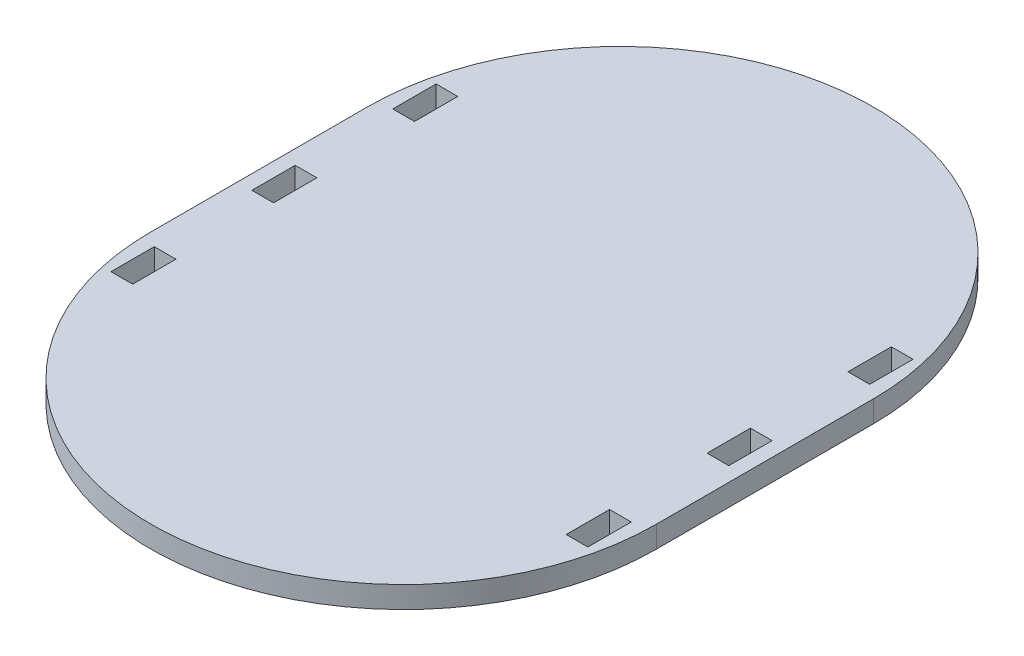
ISO-10303-21;
HEADER;
FILE_DESCRIPTION(('STEP AP214'),'2;1');
FILE_NAME('part.step','',(''),(''),'','','');
FILE_SCHEMA(('AUTOMOTIVE_DESIGN { 1 0 10303 214 1 1 1 1 }'));
ENDSEC;
DATA;
#1=APPLICATION_CONTEXT('core data for automotive mechanical design processes');
#2=APPLICATION_PROTOCOL_DEFINITION('international standard','automotive_design',2000,#1);
#3=PRODUCT_CONTEXT('',#1,'mechanical');
#4=PRODUCT('Part','Part','',(#3));
#5=PRODUCT_RELATED_PRODUCT_CATEGORY('part','',(#4));
#6=PRODUCT_DEFINITION_FORMATION('','',#4);
#7=PRODUCT_DEFINITION_CONTEXT('part definition',#1,'design');
#8=PRODUCT_DEFINITION('design','',#6,#7);
#9=PRODUCT_DEFINITION_SHAPE('','',#8);
#10=(LENGTH_UNIT() NAMED_UNIT(*) SI_UNIT(.MILLI.,.METRE.));
#11=(NAMED_UNIT(*) PLANE_ANGLE_UNIT() SI_UNIT($,.RADIAN.));
#12=(NAMED_UNIT(*) SI_UNIT($,.STERADIAN.) SOLID_ANGLE_UNIT());
#13=UNCERTAINTY_MEASURE_WITH_UNIT(LENGTH_MEASURE(1.E-05),#10,'distance_accuracy_value','');
#14=(GEOMETRIC_REPRESENTATION_CONTEXT(3) GLOBAL_UNCERTAINTY_ASSIGNED_CONTEXT((#13)) GLOBAL_UNIT_ASSIGNED_CONTEXT((#10,
#11,#12)) REPRESENTATION_CONTEXT('',''));
#15=CARTESIAN_POINT('',(0.,0.,0.));
#16=DIRECTION('',(0.,0.,1.));
#17=DIRECTION('',(1.,0.,0.));
#18=AXIS2_PLACEMENT_3D('',#15,#16,#17);
#19=CARTESIAN_POINT('',(88.9,7.62,0.));
#20=DIRECTION('',(-1.,0.,0.));
#21=DIRECTION('',(0.,0.,1.));
#22=AXIS2_PLACEMENT_3D('',#19,#20,#21);
#23=PLANE('',#22);
#24=DIRECTION('',(0.,0.,-1.));
#25=VECTOR('',#24,1.);
#26=CARTESIAN_POINT('',(88.9,0.,0.));
#27=LINE('',#26,#25);
#28=CARTESIAN_POINT('',(88.9,0.,0.));
#29=VERTEX_POINT('',#28);
#30=CARTESIAN_POINT('',(88.9,0.,-76.2));
#31=VERTEX_POINT('',#30);
#32=EDGE_CURVE('E410',#29,#31,#27,.T.);
#33=ORIENTED_EDGE('',*,*,#32,.T.);
#34=DIRECTION('',(0.,-1.,0.));
#35=VECTOR('',#34,1.);
#36=CARTESIAN_POINT('',(88.9,7.62,-76.2));
#37=LINE('',#36,#35);
#38=CARTESIAN_POINT('',(88.9,7.62,-76.2));
#39=VERTEX_POINT('',#38);
#40=EDGE_CURVE('E11',#39,#31,#37,.T.);
#41=ORIENTED_EDGE('',*,*,#40,.F.);
#42=DIRECTION('',(0.,0.,-1.));
#43=VECTOR('',#42,1.);
#44=CARTESIAN_POINT('',(88.9,7.62,0.));
#45=LINE('',#44,#43);
#46=CARTESIAN_POINT('',(88.9,7.62,0.));
#47=VERTEX_POINT('',#46);
#48=EDGE_CURVE('E417',#47,#39,#45,.T.);
#49=ORIENTED_EDGE('',*,*,#48,.F.);
#50=DIRECTION('',(0.,-1.,0.));
#51=VECTOR('',#50,1.);
#52=CARTESIAN_POINT('',(88.9,7.62,0.));
#53=LINE('',#52,#51);
#54=EDGE_CURVE('E428',#47,#29,#53,.T.);
#55=ORIENTED_EDGE('',*,*,#54,.T.);
#56=EDGE_LOOP('',(#33,#41,#49,#55));
#57=FACE_BOUND('',#56,.T.);
#58=ADVANCED_FACE('F33',(#57),#23,.F.);
#59=CARTESIAN_POINT('',(0.,7.62,-76.2));
#60=DIRECTION('',(0.,-1.,0.));
#61=DIRECTION('',(0.,0.,-1.));
#62=AXIS2_PLACEMENT_3D('',#59,#60,#61);
#63=CYLINDRICAL_SURFACE('',#62,88.9);
#64=CARTESIAN_POINT('',(0.,0.,-76.2));
#65=DIRECTION('',(0.,1.,0.));
#66=DIRECTION('',(0.,0.,1.));
#67=AXIS2_PLACEMENT_3D('',#64,#65,#66);
#68=CIRCLE('',#67,88.9);
#69=CARTESIAN_POINT('',(-88.9,0.,-76.2));
#70=VERTEX_POINT('',#69);
#71=EDGE_CURVE('E431',#31,#70,#68,.T.);
#72=ORIENTED_EDGE('',*,*,#71,.T.);
#73=DIRECTION('',(0.,-1.,0.));
#74=VECTOR('',#73,1.);
#75=CARTESIAN_POINT('',(-88.9,7.62,-76.2));
#76=LINE('',#75,#74);
#77=CARTESIAN_POINT('',(-88.9,7.62,-76.2));
#78=VERTEX_POINT('',#77);
#79=EDGE_CURVE('E40',#78,#70,#76,.T.);
#80=ORIENTED_EDGE('',*,*,#79,.F.);
#81=CARTESIAN_POINT('',(0.,7.62,-76.2));
#82=DIRECTION('',(0.,1.,0.));
#83=DIRECTION('',(0.,0.,1.));
#84=AXIS2_PLACEMENT_3D('',#81,#82,#83);
#85=CIRCLE('',#84,88.9);
#86=EDGE_CURVE('E420',#39,#78,#85,.T.);
#87=ORIENTED_EDGE('',*,*,#86,.F.);
#88=ORIENTED_EDGE('',*,*,#40,.T.);
#89=EDGE_LOOP('',(#72,#80,#87,#88));
#90=FACE_BOUND('',#89,.T.);
#91=ADVANCED_FACE('F447',(#90),#63,.T.);
#92=CARTESIAN_POINT('',(-88.9,7.62,0.));
#93=DIRECTION('',(-1.,0.,0.));
#94=DIRECTION('',(0.,0.,1.));
#95=AXIS2_PLACEMENT_3D('',#92,#93,#94);
#96=PLANE('',#95);
#97=DIRECTION('',(0.,0.,-1.));
#98=VECTOR('',#97,1.);
#99=CARTESIAN_POINT('',(-88.9,0.,0.));
#100=LINE('',#99,#98);
#101=CARTESIAN_POINT('',(-88.9,0.,0.));
#102=VERTEX_POINT('',#101);
#103=EDGE_CURVE('E434',#102,#70,#100,.T.);
#104=ORIENTED_EDGE('',*,*,#103,.F.);
#105=DIRECTION('',(0.,-1.,0.));
#106=VECTOR('',#105,1.);
#107=CARTESIAN_POINT('',(-88.9,7.62,0.));
#108=LINE('',#107,#106);
#109=CARTESIAN_POINT('',(-88.9,7.62,0.));
#110=VERTEX_POINT('',#109);
#111=EDGE_CURVE('E440',#110,#102,#108,.T.);
#112=ORIENTED_EDGE('',*,*,#111,.F.);
#113=DIRECTION('',(0.,0.,-1.));
#114=VECTOR('',#113,1.);
#115=CARTESIAN_POINT('',(-88.9,7.62,0.));
#116=LINE('',#115,#114);
#117=EDGE_CURVE('E423',#110,#78,#116,.T.);
#118=ORIENTED_EDGE('',*,*,#117,.T.);
#119=ORIENTED_EDGE('',*,*,#79,.T.);
#120=EDGE_LOOP('',(#104,#112,#118,#119));
#121=FACE_BOUND('',#120,.T.);
#122=ADVANCED_FACE('F444',(#121),#96,.T.);
#123=CARTESIAN_POINT('',(0.,7.62,0.));
#124=DIRECTION('',(0.,-1.,0.));
#125=DIRECTION('',(0.,0.,-1.));
#126=AXIS2_PLACEMENT_3D('',#123,#124,#125);
#127=CYLINDRICAL_SURFACE('',#126,88.9);
#128=CARTESIAN_POINT('',(0.,0.,0.));
#129=DIRECTION('',(0.,1.,0.));
#130=DIRECTION('',(0.,0.,1.));
#131=AXIS2_PLACEMENT_3D('',#128,#129,#130);
#132=CIRCLE('',#131,88.9);
#133=EDGE_CURVE('E421',#102,#29,#132,.T.);
#134=ORIENTED_EDGE('',*,*,#133,.T.);
#135=ORIENTED_EDGE('',*,*,#54,.F.);
#136=CARTESIAN_POINT('',(0.,7.62,0.));
#137=DIRECTION('',(0.,1.,0.));
#138=DIRECTION('',(0.,0.,1.));
#139=AXIS2_PLACEMENT_3D('',#136,#137,#138);
#140=CIRCLE('',#139,88.9);
#141=EDGE_CURVE('E426',#110,#47,#140,.T.);
#142=ORIENTED_EDGE('',*,*,#141,.F.);
#143=ORIENTED_EDGE('',*,*,#111,.T.);
#144=EDGE_LOOP('',(#134,#135,#142,#143));
#145=FACE_BOUND('',#144,.T.);
#146=ADVANCED_FACE('F454',(#145),#127,.T.);
#147=CARTESIAN_POINT('',(0.,7.62,-76.2));
#148=DIRECTION('',(0.,1.,0.));
#149=DIRECTION('',(0.,0.,1.));
#150=AXIS2_PLACEMENT_3D('',#147,#148,#149);
#151=PLANE('',#150);
#152=DIRECTION('',(0.,0.,1.));
#153=VECTOR('',#152,1.);
#154=CARTESIAN_POINT('',(-83.82,7.62,19.05));
#155=LINE('',#154,#153);
#156=CARTESIAN_POINT('',(-83.82,7.62,3.81));
#157=VERTEX_POINT('',#156);
#158=CARTESIAN_POINT('',(-83.82,7.62,19.05));
#159=VERTEX_POINT('',#158);
#160=EDGE_CURVE('E47',#157,#159,#155,.T.);
#161=ORIENTED_EDGE('',*,*,#160,.F.);
#162=DIRECTION('',(-1.,0.,0.));
#163=VECTOR('',#162,1.);
#164=CARTESIAN_POINT('',(-83.82,7.62,3.81));
#165=LINE('',#164,#163);
#166=CARTESIAN_POINT('',(-76.2,7.62,3.81));
#167=VERTEX_POINT('',#166);
#168=EDGE_CURVE('E265',#167,#157,#165,.T.);
#169=ORIENTED_EDGE('',*,*,#168,.F.);
#170=DIRECTION('',(0.,0.,-1.));
#171=VECTOR('',#170,1.);
#172=CARTESIAN_POINT('',(-76.2,7.62,19.05));
#173=LINE('',#172,#171);
#174=CARTESIAN_POINT('',(-76.2,7.62,19.05));
#175=VERTEX_POINT('',#174);
#176=EDGE_CURVE('E280',#175,#167,#173,.T.);
#177=ORIENTED_EDGE('',*,*,#176,.F.);
#178=DIRECTION('',(1.,0.,0.));
#179=VECTOR('',#178,1.);
#180=CARTESIAN_POINT('',(-83.82,7.62,19.05));
#181=LINE('',#180,#179);
#182=EDGE_CURVE('E276',#159,#175,#181,.T.);
#183=ORIENTED_EDGE('',*,*,#182,.F.);
#184=EDGE_LOOP('',(#161,#169,#177,#183));
#185=FACE_BOUND('',#184,.T.);
#186=DIRECTION('',(0.,0.,-1.));
#187=VECTOR('',#186,1.);
#188=CARTESIAN_POINT('',(83.82,7.62,19.05));
#189=LINE('',#188,#187);
#190=CARTESIAN_POINT('',(83.82,7.62,19.05));
#191=VERTEX_POINT('',#190);
#192=CARTESIAN_POINT('',(83.82,7.62,3.80999999999999));
#193=VERTEX_POINT('',#192);
#194=EDGE_CURVE('E55',#191,#193,#189,.T.);
#195=ORIENTED_EDGE('',*,*,#194,.F.);
#196=DIRECTION('',(1.,0.,0.));
#197=VECTOR('',#196,1.);
#198=CARTESIAN_POINT('',(83.82,7.62,19.05));
#199=LINE('',#198,#197);
#200=CARTESIAN_POINT('',(76.2,7.62,19.05));
#201=VERTEX_POINT('',#200);
#202=EDGE_CURVE('E297',#201,#191,#199,.T.);
#203=ORIENTED_EDGE('',*,*,#202,.F.);
#204=DIRECTION('',(0.,0.,1.));
#205=VECTOR('',#204,1.);
#206=CARTESIAN_POINT('',(76.2,7.62,19.05));
#207=LINE('',#206,#205);
#208=CARTESIAN_POINT('',(76.2,7.62,3.81));
#209=VERTEX_POINT('',#208);
#210=EDGE_CURVE('E312',#209,#201,#207,.T.);
#211=ORIENTED_EDGE('',*,*,#210,.F.);
#212=DIRECTION('',(-1.,0.,0.));
#213=VECTOR('',#212,1.);
#214=CARTESIAN_POINT('',(83.82,7.62,3.81));
#215=LINE('',#214,#213);
#216=EDGE_CURVE('E308',#193,#209,#215,.T.);
#217=ORIENTED_EDGE('',*,*,#216,.F.);
#218=EDGE_LOOP('',(#195,#203,#211,#217));
#219=FACE_BOUND('',#218,.T.);
#220=DIRECTION('',(0.,0.,-1.));
#221=VECTOR('',#220,1.);
#222=CARTESIAN_POINT('',(83.82,7.62,-95.25));
#223=LINE('',#222,#221);
#224=CARTESIAN_POINT('',(83.82,7.62,-80.01));
#225=VERTEX_POINT('',#224);
#226=CARTESIAN_POINT('',(83.82,7.62,-95.25));
#227=VERTEX_POINT('',#226);
#228=EDGE_CURVE('E337',#225,#227,#223,.T.);
#229=ORIENTED_EDGE('',*,*,#228,.F.);
#230=DIRECTION('',(1.,0.,0.));
#231=VECTOR('',#230,1.);
#232=CARTESIAN_POINT('',(83.82,7.62,-80.01));
#233=LINE('',#232,#231);
#234=CARTESIAN_POINT('',(76.2,7.62,-80.01));
#235=VERTEX_POINT('',#234);
#236=EDGE_CURVE('E327',#235,#225,#233,.T.);
#237=ORIENTED_EDGE('',*,*,#236,.F.);
#238=DIRECTION('',(0.,0.,1.));
#239=VECTOR('',#238,1.);
#240=CARTESIAN_POINT('',(76.2,7.62,-95.25));
#241=LINE('',#240,#239);
#242=CARTESIAN_POINT('',(76.2,7.62,-95.25));
#243=VERTEX_POINT('',#242);
#244=EDGE_CURVE('E343',#243,#235,#241,.T.);
#245=ORIENTED_EDGE('',*,*,#244,.F.);
#246=DIRECTION('',(-1.,0.,0.));
#247=VECTOR('',#246,1.);
#248=CARTESIAN_POINT('',(83.82,7.62,-95.25));
#249=LINE('',#248,#247);
#250=EDGE_CURVE('E339',#227,#243,#249,.T.);
#251=ORIENTED_EDGE('',*,*,#250,.F.);
#252=EDGE_LOOP('',(#229,#237,#245,#251));
#253=FACE_BOUND('',#252,.T.);
#254=DIRECTION('',(0.,0.,1.));
#255=VECTOR('',#254,1.);
#256=CARTESIAN_POINT('',(-83.82,7.62,-45.72));
#257=LINE('',#256,#255);
#258=CARTESIAN_POINT('',(-83.82,7.62,-45.72));
#259=VERTEX_POINT('',#258);
#260=CARTESIAN_POINT('',(-83.82,7.62,-30.48));
#261=VERTEX_POINT('',#260);
#262=EDGE_CURVE('E257',#259,#261,#257,.T.);
#263=ORIENTED_EDGE('',*,*,#262,.F.);
#264=DIRECTION('',(-1.,0.,0.));
#265=VECTOR('',#264,1.);
#266=CARTESIAN_POINT('',(-83.82,7.62,-45.72));
#267=LINE('',#266,#265);
#268=CARTESIAN_POINT('',(-76.2,7.62,-45.72));
#269=VERTEX_POINT('',#268);
#270=EDGE_CURVE('E359',#269,#259,#267,.T.);
#271=ORIENTED_EDGE('',*,*,#270,.F.);
#272=DIRECTION('',(0.,0.,-1.));
#273=VECTOR('',#272,1.);
#274=CARTESIAN_POINT('',(-76.2,7.62,-45.72));
#275=LINE('',#274,#273);
#276=CARTESIAN_POINT('',(-76.2,7.62,-30.48));
#277=VERTEX_POINT('',#276);
#278=EDGE_CURVE('E373',#277,#269,#275,.T.);
#279=ORIENTED_EDGE('',*,*,#278,.F.);
#280=DIRECTION('',(1.,0.,0.));
#281=VECTOR('',#280,1.);
#282=CARTESIAN_POINT('',(-83.82,7.62,-30.48));
#283=LINE('',#282,#281);
#284=EDGE_CURVE('E370',#261,#277,#283,.T.);
#285=ORIENTED_EDGE('',*,*,#284,.F.);
#286=EDGE_LOOP('',(#263,#271,#279,#285));
#287=FACE_BOUND('',#286,.T.);
#288=DIRECTION('',(0.,0.,-1.));
#289=VECTOR('',#288,1.);
#290=CARTESIAN_POINT('',(83.82,7.62,-45.72));
#291=LINE('',#290,#289);
#292=CARTESIAN_POINT('',(83.82,7.62,-30.48));
#293=VERTEX_POINT('',#292);
#294=CARTESIAN_POINT('',(83.82,7.62,-45.72));
#295=VERTEX_POINT('',#294);
#296=EDGE_CURVE('E224',#293,#295,#291,.T.);
#297=ORIENTED_EDGE('',*,*,#296,.F.);
#298=DIRECTION('',(1.,0.,0.));
#299=VECTOR('',#298,1.);
#300=CARTESIAN_POINT('',(83.82,7.62,-30.48));
#301=LINE('',#300,#299);
#302=CARTESIAN_POINT('',(76.2,7.62,-30.48));
#303=VERTEX_POINT('',#302);
#304=EDGE_CURVE('E242',#303,#293,#301,.T.);
#305=ORIENTED_EDGE('',*,*,#304,.F.);
#306=DIRECTION('',(0.,0.,1.));
#307=VECTOR('',#306,1.);
#308=CARTESIAN_POINT('',(76.2,7.62,-45.72));
#309=LINE('',#308,#307);
#310=CARTESIAN_POINT('',(76.2,7.62,-45.72));
#311=VERTEX_POINT('',#310);
#312=EDGE_CURVE('E245',#311,#303,#309,.T.);
#313=ORIENTED_EDGE('',*,*,#312,.F.);
#314=DIRECTION('',(-1.,0.,0.));
#315=VECTOR('',#314,1.);
#316=CARTESIAN_POINT('',(83.82,7.62,-45.72));
#317=LINE('',#316,#315);
#318=EDGE_CURVE('E251',#295,#311,#317,.T.);
#319=ORIENTED_EDGE('',*,*,#318,.F.);
#320=EDGE_LOOP('',(#297,#305,#313,#319));
#321=FACE_BOUND('',#320,.T.);
#322=DIRECTION('',(0.,0.,1.));
#323=VECTOR('',#322,1.);
#324=CARTESIAN_POINT('',(-83.82,7.62,-95.25));
#325=LINE('',#324,#323);
#326=CARTESIAN_POINT('',(-83.82,7.62,-95.25));
#327=VERTEX_POINT('',#326);
#328=CARTESIAN_POINT('',(-83.82,7.62,-80.01));
#329=VERTEX_POINT('',#328);
#330=EDGE_CURVE('E287',#327,#329,#325,.T.);
#331=ORIENTED_EDGE('',*,*,#330,.F.);
#332=DIRECTION('',(-1.,0.,0.));
#333=VECTOR('',#332,1.);
#334=CARTESIAN_POINT('',(-83.82,7.62,-95.25));
#335=LINE('',#334,#333);
#336=CARTESIAN_POINT('',(-76.2,7.62,-95.25));
#337=VERTEX_POINT('',#336);
#338=EDGE_CURVE('E389',#337,#327,#335,.T.);
#339=ORIENTED_EDGE('',*,*,#338,.F.);
#340=DIRECTION('',(0.,0.,-1.));
#341=VECTOR('',#340,1.);
#342=CARTESIAN_POINT('',(-76.2,7.62,-95.25));
#343=LINE('',#342,#341);
#344=CARTESIAN_POINT('',(-76.2,7.62,-80.01));
#345=VERTEX_POINT('',#344);
#346=EDGE_CURVE('E403',#345,#337,#343,.T.);
#347=ORIENTED_EDGE('',*,*,#346,.F.);
#348=DIRECTION('',(1.,0.,0.));
#349=VECTOR('',#348,1.);
#350=CARTESIAN_POINT('',(-83.82,7.62,-80.01));
#351=LINE('',#350,#349);
#352=EDGE_CURVE('E400',#329,#345,#351,.T.);
#353=ORIENTED_EDGE('',*,*,#352,.F.);
#354=EDGE_LOOP('',(#331,#339,#347,#353));
#355=FACE_BOUND('',#354,.T.);
#356=ORIENTED_EDGE('',*,*,#48,.T.);
#357=ORIENTED_EDGE('',*,*,#86,.T.);
#358=ORIENTED_EDGE('',*,*,#117,.F.);
#359=ORIENTED_EDGE('',*,*,#141,.T.);
#360=EDGE_LOOP('',(#356,#357,#358,#359));
#361=FACE_BOUND('',#360,.T.);
#362=ADVANCED_FACE('F459',(#185,#219,#253,#287,#321,#355,#361),#151,.T.);
#363=CARTESIAN_POINT('',(0.,0.,-76.2));
#364=DIRECTION('',(0.,1.,0.));
#365=DIRECTION('',(0.,0.,1.));
#366=AXIS2_PLACEMENT_3D('',#363,#364,#365);
#367=PLANE('',#366);
#368=DIRECTION('',(-1.,0.,0.));
#369=VECTOR('',#368,1.);
#370=CARTESIAN_POINT('',(-83.82,0.,3.81));
#371=LINE('',#370,#369);
#372=CARTESIAN_POINT('',(-76.2,0.,3.81));
#373=VERTEX_POINT('',#372);
#374=CARTESIAN_POINT('',(-83.82,0.,3.81));
#375=VERTEX_POINT('',#374);
#376=EDGE_CURVE('E271',#373,#375,#371,.T.);
#377=ORIENTED_EDGE('',*,*,#376,.T.);
#378=DIRECTION('',(0.,0.,1.));
#379=VECTOR('',#378,1.);
#380=CARTESIAN_POINT('',(-83.82,0.,19.05));
#381=LINE('',#380,#379);
#382=CARTESIAN_POINT('',(-83.82,0.,19.05));
#383=VERTEX_POINT('',#382);
#384=EDGE_CURVE('E261',#375,#383,#381,.T.);
#385=ORIENTED_EDGE('',*,*,#384,.T.);
#386=DIRECTION('',(1.,0.,0.));
#387=VECTOR('',#386,1.);
#388=CARTESIAN_POINT('',(-83.82,0.,19.05));
#389=LINE('',#388,#387);
#390=CARTESIAN_POINT('',(-76.2,0.,19.05));
#391=VERTEX_POINT('',#390);
#392=EDGE_CURVE('E264',#383,#391,#389,.T.);
#393=ORIENTED_EDGE('',*,*,#392,.T.);
#394=DIRECTION('',(0.,0.,-1.));
#395=VECTOR('',#394,1.);
#396=CARTESIAN_POINT('',(-76.2,0.,19.05));
#397=LINE('',#396,#395);
#398=EDGE_CURVE('E268',#391,#373,#397,.T.);
#399=ORIENTED_EDGE('',*,*,#398,.T.);
#400=EDGE_LOOP('',(#377,#385,#393,#399));
#401=FACE_BOUND('',#400,.T.);
#402=DIRECTION('',(1.,0.,0.));
#403=VECTOR('',#402,1.);
#404=CARTESIAN_POINT('',(83.82,0.,19.05));
#405=LINE('',#404,#403);
#406=CARTESIAN_POINT('',(76.2,0.,19.05));
#407=VERTEX_POINT('',#406);
#408=CARTESIAN_POINT('',(83.82,0.,19.05));
#409=VERTEX_POINT('',#408);
#410=EDGE_CURVE('E303',#407,#409,#405,.T.);
#411=ORIENTED_EDGE('',*,*,#410,.T.);
#412=DIRECTION('',(0.,0.,-1.));
#413=VECTOR('',#412,1.);
#414=CARTESIAN_POINT('',(83.82,0.,19.05));
#415=LINE('',#414,#413);
#416=CARTESIAN_POINT('',(83.82,0.,3.81));
#417=VERTEX_POINT('',#416);
#418=EDGE_CURVE('E293',#409,#417,#415,.T.);
#419=ORIENTED_EDGE('',*,*,#418,.T.);
#420=DIRECTION('',(-1.,0.,0.));
#421=VECTOR('',#420,1.);
#422=CARTESIAN_POINT('',(83.82,0.,3.81));
#423=LINE('',#422,#421);
#424=CARTESIAN_POINT('',(76.2,0.,3.80999999999999));
#425=VERTEX_POINT('',#424);
#426=EDGE_CURVE('E296',#417,#425,#423,.T.);
#427=ORIENTED_EDGE('',*,*,#426,.T.);
#428=DIRECTION('',(0.,0.,1.));
#429=VECTOR('',#428,1.);
#430=CARTESIAN_POINT('',(76.2,0.,19.05));
#431=LINE('',#430,#429);
#432=EDGE_CURVE('E300',#425,#407,#431,.T.);
#433=ORIENTED_EDGE('',*,*,#432,.T.);
#434=EDGE_LOOP('',(#411,#419,#427,#433));
#435=FACE_BOUND('',#434,.T.);
#436=DIRECTION('',(1.,0.,0.));
#437=VECTOR('',#436,1.);
#438=CARTESIAN_POINT('',(83.82,0.,-80.01));
#439=LINE('',#438,#437);
#440=CARTESIAN_POINT('',(76.2,0.,-80.01));
#441=VERTEX_POINT('',#440);
#442=CARTESIAN_POINT('',(83.82,0.,-80.01));
#443=VERTEX_POINT('',#442);
#444=EDGE_CURVE('E333',#441,#443,#439,.T.);
#445=ORIENTED_EDGE('',*,*,#444,.T.);
#446=DIRECTION('',(0.,0.,-1.));
#447=VECTOR('',#446,1.);
#448=CARTESIAN_POINT('',(83.82,0.,-95.25));
#449=LINE('',#448,#447);
#450=CARTESIAN_POINT('',(83.82,0.,-95.25));
#451=VERTEX_POINT('',#450);
#452=EDGE_CURVE('E323',#443,#451,#449,.T.);
#453=ORIENTED_EDGE('',*,*,#452,.T.);
#454=DIRECTION('',(-1.,0.,0.));
#455=VECTOR('',#454,1.);
#456=CARTESIAN_POINT('',(83.82,0.,-95.25));
#457=LINE('',#456,#455);
#458=CARTESIAN_POINT('',(76.2,0.,-95.25));
#459=VERTEX_POINT('',#458);
#460=EDGE_CURVE('E326',#451,#459,#457,.T.);
#461=ORIENTED_EDGE('',*,*,#460,.T.);
#462=DIRECTION('',(0.,0.,1.));
#463=VECTOR('',#462,1.);
#464=CARTESIAN_POINT('',(76.2,0.,-95.25));
#465=LINE('',#464,#463);
#466=EDGE_CURVE('E330',#459,#441,#465,.T.);
#467=ORIENTED_EDGE('',*,*,#466,.T.);
#468=EDGE_LOOP('',(#445,#453,#461,#467));
#469=FACE_BOUND('',#468,.T.);
#470=DIRECTION('',(-1.,0.,0.));
#471=VECTOR('',#470,1.);
#472=CARTESIAN_POINT('',(-83.82,0.,-45.72));
#473=LINE('',#472,#471);
#474=CARTESIAN_POINT('',(-76.2,0.,-45.72));
#475=VERTEX_POINT('',#474);
#476=CARTESIAN_POINT('',(-83.82,0.,-45.72));
#477=VERTEX_POINT('',#476);
#478=EDGE_CURVE('E365',#475,#477,#473,.T.);
#479=ORIENTED_EDGE('',*,*,#478,.T.);
#480=DIRECTION('',(0.,0.,1.));
#481=VECTOR('',#480,1.);
#482=CARTESIAN_POINT('',(-83.82,0.,-45.72));
#483=LINE('',#482,#481);
#484=CARTESIAN_POINT('',(-83.82,0.,-30.48));
#485=VERTEX_POINT('',#484);
#486=EDGE_CURVE('E355',#477,#485,#483,.T.);
#487=ORIENTED_EDGE('',*,*,#486,.T.);
#488=DIRECTION('',(1.,0.,0.));
#489=VECTOR('',#488,1.);
#490=CARTESIAN_POINT('',(-83.82,0.,-30.48));
#491=LINE('',#490,#489);
#492=CARTESIAN_POINT('',(-76.2,0.,-30.48));
#493=VERTEX_POINT('',#492);
#494=EDGE_CURVE('E358',#485,#493,#491,.T.);
#495=ORIENTED_EDGE('',*,*,#494,.T.);
#496=DIRECTION('',(0.,0.,-1.));
#497=VECTOR('',#496,1.);
#498=CARTESIAN_POINT('',(-76.2,0.,-45.72));
#499=LINE('',#498,#497);
#500=EDGE_CURVE('E362',#493,#475,#499,.T.);
#501=ORIENTED_EDGE('',*,*,#500,.T.);
#502=EDGE_LOOP('',(#479,#487,#495,#501));
#503=FACE_BOUND('',#502,.T.);
#504=DIRECTION('',(1.,0.,0.));
#505=VECTOR('',#504,1.);
#506=CARTESIAN_POINT('',(83.82,0.,-30.48));
#507=LINE('',#506,#505);
#508=CARTESIAN_POINT('',(76.2,0.,-30.48));
#509=VERTEX_POINT('',#508);
#510=CARTESIAN_POINT('',(83.82,0.,-30.48));
#511=VERTEX_POINT('',#510);
#512=EDGE_CURVE('E229',#509,#511,#507,.T.);
#513=ORIENTED_EDGE('',*,*,#512,.T.);
#514=DIRECTION('',(0.,0.,-1.));
#515=VECTOR('',#514,1.);
#516=CARTESIAN_POINT('',(83.82,0.,-45.72));
#517=LINE('',#516,#515);
#518=CARTESIAN_POINT('',(83.82,0.,-45.72));
#519=VERTEX_POINT('',#518);
#520=EDGE_CURVE('E221',#511,#519,#517,.T.);
#521=ORIENTED_EDGE('',*,*,#520,.T.);
#522=DIRECTION('',(-1.,0.,0.));
#523=VECTOR('',#522,1.);
#524=CARTESIAN_POINT('',(83.82,0.,-45.72));
#525=LINE('',#524,#523);
#526=CARTESIAN_POINT('',(76.2,0.,-45.72));
#527=VERTEX_POINT('',#526);
#528=EDGE_CURVE('E233',#519,#527,#525,.T.);
#529=ORIENTED_EDGE('',*,*,#528,.T.);
#530=DIRECTION('',(0.,0.,1.));
#531=VECTOR('',#530,1.);
#532=CARTESIAN_POINT('',(76.2,0.,-45.72));
#533=LINE('',#532,#531);
#534=EDGE_CURVE('E237',#527,#509,#533,.T.);
#535=ORIENTED_EDGE('',*,*,#534,.T.);
#536=EDGE_LOOP('',(#513,#521,#529,#535));
#537=FACE_BOUND('',#536,.T.);
#538=DIRECTION('',(-1.,0.,0.));
#539=VECTOR('',#538,1.);
#540=CARTESIAN_POINT('',(-83.82,0.,-95.25));
#541=LINE('',#540,#539);
#542=CARTESIAN_POINT('',(-76.2,0.,-95.25));
#543=VERTEX_POINT('',#542);
#544=CARTESIAN_POINT('',(-83.82,0.,-95.25));
#545=VERTEX_POINT('',#544);
#546=EDGE_CURVE('E395',#543,#545,#541,.T.);
#547=ORIENTED_EDGE('',*,*,#546,.T.);
#548=DIRECTION('',(0.,0.,1.));
#549=VECTOR('',#548,1.);
#550=CARTESIAN_POINT('',(-83.82,0.,-95.25));
#551=LINE('',#550,#549);
#552=CARTESIAN_POINT('',(-83.82,0.,-80.01));
#553=VERTEX_POINT('',#552);
#554=EDGE_CURVE('E385',#545,#553,#551,.T.);
#555=ORIENTED_EDGE('',*,*,#554,.T.);
#556=DIRECTION('',(1.,0.,0.));
#557=VECTOR('',#556,1.);
#558=CARTESIAN_POINT('',(-83.82,0.,-80.01));
#559=LINE('',#558,#557);
#560=CARTESIAN_POINT('',(-76.2,0.,-80.01));
#561=VERTEX_POINT('',#560);
#562=EDGE_CURVE('E388',#553,#561,#559,.T.);
#563=ORIENTED_EDGE('',*,*,#562,.T.);
#564=DIRECTION('',(0.,0.,-1.));
#565=VECTOR('',#564,1.);
#566=CARTESIAN_POINT('',(-76.2,0.,-95.25));
#567=LINE('',#566,#565);
#568=EDGE_CURVE('E392',#561,#543,#567,.T.);
#569=ORIENTED_EDGE('',*,*,#568,.T.);
#570=EDGE_LOOP('',(#547,#555,#563,#569));
#571=FACE_BOUND('',#570,.T.);
#572=ORIENTED_EDGE('',*,*,#32,.F.);
#573=ORIENTED_EDGE('',*,*,#133,.F.);
#574=ORIENTED_EDGE('',*,*,#103,.T.);
#575=ORIENTED_EDGE('',*,*,#71,.F.);
#576=EDGE_LOOP('',(#572,#573,#574,#575));
#577=FACE_BOUND('',#576,.T.);
#578=ADVANCED_FACE('F239',(#401,#435,#469,#503,#537,#571,#577),#367,.F.);
#579=CARTESIAN_POINT('',(-83.82,0.,-95.25));
#580=DIRECTION('',(-1.,0.,0.));
#581=DIRECTION('',(0.,0.,1.));
#582=AXIS2_PLACEMENT_3D('',#579,#580,#581);
#583=PLANE('',#582);
#584=ORIENTED_EDGE('',*,*,#330,.T.);
#585=DIRECTION('',(0.,1.,0.));
#586=VECTOR('',#585,1.);
#587=CARTESIAN_POINT('',(-83.82,0.,-80.01));
#588=LINE('',#587,#586);
#589=EDGE_CURVE('E398',#553,#329,#588,.T.);
#590=ORIENTED_EDGE('',*,*,#589,.F.);
#591=ORIENTED_EDGE('',*,*,#554,.F.);
#592=DIRECTION('',(0.,1.,0.));
#593=VECTOR('',#592,1.);
#594=CARTESIAN_POINT('',(-83.82,0.,-95.25));
#595=LINE('',#594,#593);
#596=EDGE_CURVE('E408',#545,#327,#595,.T.);
#597=ORIENTED_EDGE('',*,*,#596,.T.);
#598=EDGE_LOOP('',(#584,#590,#591,#597));
#599=FACE_BOUND('',#598,.T.);
#600=ADVANCED_FACE('F467',(#599),#583,.F.);
#601=CARTESIAN_POINT('',(-83.82,0.,-95.25));
#602=DIRECTION('',(0.,0.,-1.));
#603=DIRECTION('',(-1.,0.,0.));
#604=AXIS2_PLACEMENT_3D('',#601,#602,#603);
#605=PLANE('',#604);
#606=ORIENTED_EDGE('',*,*,#338,.T.);
#607=ORIENTED_EDGE('',*,*,#596,.F.);
#608=ORIENTED_EDGE('',*,*,#546,.F.);
#609=DIRECTION('',(0.,1.,0.));
#610=VECTOR('',#609,1.);
#611=CARTESIAN_POINT('',(-76.2,0.,-95.25));
#612=LINE('',#611,#610);
#613=EDGE_CURVE('E411',#543,#337,#612,.T.);
#614=ORIENTED_EDGE('',*,*,#613,.T.);
#615=EDGE_LOOP('',(#606,#607,#608,#614));
#616=FACE_BOUND('',#615,.T.);
#617=ADVANCED_FACE('F506',(#616),#605,.F.);
#618=CARTESIAN_POINT('',(-76.2,0.,-95.25));
#619=DIRECTION('',(1.,0.,0.));
#620=DIRECTION('',(0.,0.,-1.));
#621=AXIS2_PLACEMENT_3D('',#618,#619,#620);
#622=PLANE('',#621);
#623=ORIENTED_EDGE('',*,*,#346,.T.);
#624=ORIENTED_EDGE('',*,*,#613,.F.);
#625=ORIENTED_EDGE('',*,*,#568,.F.);
#626=DIRECTION('',(0.,1.,0.));
#627=VECTOR('',#626,1.);
#628=CARTESIAN_POINT('',(-76.2,0.,-80.01));
#629=LINE('',#628,#627);
#630=EDGE_CURVE('E413',#561,#345,#629,.T.);
#631=ORIENTED_EDGE('',*,*,#630,.T.);
#632=EDGE_LOOP('',(#623,#624,#625,#631));
#633=FACE_BOUND('',#632,.T.);
#634=ADVANCED_FACE('F515',(#633),#622,.F.);
#635=CARTESIAN_POINT('',(-83.82,0.,-80.01));
#636=DIRECTION('',(0.,0.,1.));
#637=DIRECTION('',(1.,0.,0.));
#638=AXIS2_PLACEMENT_3D('',#635,#636,#637);
#639=PLANE('',#638);
#640=ORIENTED_EDGE('',*,*,#352,.T.);
#641=ORIENTED_EDGE('',*,*,#630,.F.);
#642=ORIENTED_EDGE('',*,*,#562,.F.);
#643=ORIENTED_EDGE('',*,*,#589,.T.);
#644=EDGE_LOOP('',(#640,#641,#642,#643));
#645=FACE_BOUND('',#644,.T.);
#646=ADVANCED_FACE('F525',(#645),#639,.F.);
#647=CARTESIAN_POINT('',(83.82,0.,-45.72));
#648=DIRECTION('',(1.,0.,0.));
#649=DIRECTION('',(0.,0.,-1.));
#650=AXIS2_PLACEMENT_3D('',#647,#648,#649);
#651=PLANE('',#650);
#652=ORIENTED_EDGE('',*,*,#296,.T.);
#653=DIRECTION('',(0.,1.,0.));
#654=VECTOR('',#653,1.);
#655=CARTESIAN_POINT('',(83.82,0.,-45.72));
#656=LINE('',#655,#654);
#657=EDGE_CURVE('E217',#519,#295,#656,.T.);
#658=ORIENTED_EDGE('',*,*,#657,.F.);
#659=ORIENTED_EDGE('',*,*,#520,.F.);
#660=DIRECTION('',(0.,1.,0.));
#661=VECTOR('',#660,1.);
#662=CARTESIAN_POINT('',(83.82,0.,-30.48));
#663=LINE('',#662,#661);
#664=EDGE_CURVE('E255',#511,#293,#663,.T.);
#665=ORIENTED_EDGE('',*,*,#664,.T.);
#666=EDGE_LOOP('',(#652,#658,#659,#665));
#667=FACE_BOUND('',#666,.T.);
#668=ADVANCED_FACE('F219',(#667),#651,.F.);
#669=CARTESIAN_POINT('',(83.82,0.,-30.48));
#670=DIRECTION('',(0.,0.,1.));
#671=DIRECTION('',(1.,0.,0.));
#672=AXIS2_PLACEMENT_3D('',#669,#670,#671);
#673=PLANE('',#672);
#674=ORIENTED_EDGE('',*,*,#304,.T.);
#675=ORIENTED_EDGE('',*,*,#664,.F.);
#676=ORIENTED_EDGE('',*,*,#512,.F.);
#677=DIRECTION('',(0.,1.,0.));
#678=VECTOR('',#677,1.);
#679=CARTESIAN_POINT('',(76.2,0.,-30.48));
#680=LINE('',#679,#678);
#681=EDGE_CURVE('E258',#509,#303,#680,.T.);
#682=ORIENTED_EDGE('',*,*,#681,.T.);
#683=EDGE_LOOP('',(#674,#675,#676,#682));
#684=FACE_BOUND('',#683,.T.);
#685=ADVANCED_FACE('F544',(#684),#673,.F.);
#686=CARTESIAN_POINT('',(76.2,0.,-45.72));
#687=DIRECTION('',(-1.,0.,0.));
#688=DIRECTION('',(0.,0.,1.));
#689=AXIS2_PLACEMENT_3D('',#686,#687,#688);
#690=PLANE('',#689);
#691=ORIENTED_EDGE('',*,*,#312,.T.);
#692=ORIENTED_EDGE('',*,*,#681,.F.);
#693=ORIENTED_EDGE('',*,*,#534,.F.);
#694=DIRECTION('',(0.,1.,0.));
#695=VECTOR('',#694,1.);
#696=CARTESIAN_POINT('',(76.2,0.,-45.72));
#697=LINE('',#696,#695);
#698=EDGE_CURVE('E228',#527,#311,#697,.T.);
#699=ORIENTED_EDGE('',*,*,#698,.T.);
#700=EDGE_LOOP('',(#691,#692,#693,#699));
#701=FACE_BOUND('',#700,.T.);
#702=ADVANCED_FACE('F553',(#701),#690,.F.);
#703=CARTESIAN_POINT('',(83.82,0.,-45.72));
#704=DIRECTION('',(0.,0.,-1.));
#705=DIRECTION('',(-1.,0.,0.));
#706=AXIS2_PLACEMENT_3D('',#703,#704,#705);
#707=PLANE('',#706);
#708=ORIENTED_EDGE('',*,*,#318,.T.);
#709=ORIENTED_EDGE('',*,*,#698,.F.);
#710=ORIENTED_EDGE('',*,*,#528,.F.);
#711=ORIENTED_EDGE('',*,*,#657,.T.);
#712=EDGE_LOOP('',(#708,#709,#710,#711));
#713=FACE_BOUND('',#712,.T.);
#714=ADVANCED_FACE('F234',(#713),#707,.F.);
#715=CARTESIAN_POINT('',(-83.82,0.,-45.72));
#716=DIRECTION('',(-1.,0.,0.));
#717=DIRECTION('',(0.,0.,1.));
#718=AXIS2_PLACEMENT_3D('',#715,#716,#717);
#719=PLANE('',#718);
#720=ORIENTED_EDGE('',*,*,#262,.T.);
#721=DIRECTION('',(0.,1.,0.));
#722=VECTOR('',#721,1.);
#723=CARTESIAN_POINT('',(-83.82,0.,-30.48));
#724=LINE('',#723,#722);
#725=EDGE_CURVE('E368',#485,#261,#724,.T.);
#726=ORIENTED_EDGE('',*,*,#725,.F.);
#727=ORIENTED_EDGE('',*,*,#486,.F.);
#728=DIRECTION('',(0.,1.,0.));
#729=VECTOR('',#728,1.);
#730=CARTESIAN_POINT('',(-83.82,0.,-45.72));
#731=LINE('',#730,#729);
#732=EDGE_CURVE('E340',#477,#259,#731,.T.);
#733=ORIENTED_EDGE('',*,*,#732,.T.);
#734=EDGE_LOOP('',(#720,#726,#727,#733));
#735=FACE_BOUND('',#734,.T.);
#736=ADVANCED_FACE('F572',(#735),#719,.F.);
#737=CARTESIAN_POINT('',(-83.82,0.,-45.72));
#738=DIRECTION('',(0.,0.,-1.));
#739=DIRECTION('',(-1.,0.,0.));
#740=AXIS2_PLACEMENT_3D('',#737,#738,#739);
#741=PLANE('',#740);
#742=ORIENTED_EDGE('',*,*,#270,.T.);
#743=ORIENTED_EDGE('',*,*,#732,.F.);
#744=ORIENTED_EDGE('',*,*,#478,.F.);
#745=DIRECTION('',(0.,1.,0.));
#746=VECTOR('',#745,1.);
#747=CARTESIAN_POINT('',(-76.2,0.,-45.72));
#748=LINE('',#747,#746);
#749=EDGE_CURVE('E379',#475,#269,#748,.T.);
#750=ORIENTED_EDGE('',*,*,#749,.T.);
#751=EDGE_LOOP('',(#742,#743,#744,#750));
#752=FACE_BOUND('',#751,.T.);
#753=ADVANCED_FACE('F581',(#752),#741,.F.);
#754=CARTESIAN_POINT('',(-76.2,0.,-45.72));
#755=DIRECTION('',(1.,0.,0.));
#756=DIRECTION('',(0.,0.,-1.));
#757=AXIS2_PLACEMENT_3D('',#754,#755,#756);
#758=PLANE('',#757);
#759=ORIENTED_EDGE('',*,*,#278,.T.);
#760=ORIENTED_EDGE('',*,*,#749,.F.);
#761=ORIENTED_EDGE('',*,*,#500,.F.);
#762=DIRECTION('',(0.,1.,0.));
#763=VECTOR('',#762,1.);
#764=CARTESIAN_POINT('',(-76.2,0.,-30.48));
#765=LINE('',#764,#763);
#766=EDGE_CURVE('E381',#493,#277,#765,.T.);
#767=ORIENTED_EDGE('',*,*,#766,.T.);
#768=EDGE_LOOP('',(#759,#760,#761,#767));
#769=FACE_BOUND('',#768,.T.);
#770=ADVANCED_FACE('F591',(#769),#758,.F.);
#771=CARTESIAN_POINT('',(-83.82,0.,-30.48));
#772=DIRECTION('',(0.,0.,1.));
#773=DIRECTION('',(1.,0.,0.));
#774=AXIS2_PLACEMENT_3D('',#771,#772,#773);
#775=PLANE('',#774);
#776=ORIENTED_EDGE('',*,*,#284,.T.);
#777=ORIENTED_EDGE('',*,*,#766,.F.);
#778=ORIENTED_EDGE('',*,*,#494,.F.);
#779=ORIENTED_EDGE('',*,*,#725,.T.);
#780=EDGE_LOOP('',(#776,#777,#778,#779));
#781=FACE_BOUND('',#780,.T.);
#782=ADVANCED_FACE('F601',(#781),#775,.F.);
#783=CARTESIAN_POINT('',(83.82,0.,-95.25));
#784=DIRECTION('',(1.,0.,0.));
#785=DIRECTION('',(0.,0.,-1.));
#786=AXIS2_PLACEMENT_3D('',#783,#784,#785);
#787=PLANE('',#786);
#788=ORIENTED_EDGE('',*,*,#228,.T.);
#789=DIRECTION('',(0.,1.,0.));
#790=VECTOR('',#789,1.);
#791=CARTESIAN_POINT('',(83.82,0.,-95.25));
#792=LINE('',#791,#790);
#793=EDGE_CURVE('E336',#451,#227,#792,.T.);
#794=ORIENTED_EDGE('',*,*,#793,.F.);
#795=ORIENTED_EDGE('',*,*,#452,.F.);
#796=DIRECTION('',(0.,1.,0.));
#797=VECTOR('',#796,1.);
#798=CARTESIAN_POINT('',(83.82,0.,-80.01));
#799=LINE('',#798,#797);
#800=EDGE_CURVE('E309',#443,#225,#799,.T.);
#801=ORIENTED_EDGE('',*,*,#800,.T.);
#802=EDGE_LOOP('',(#788,#794,#795,#801));
#803=FACE_BOUND('',#802,.T.);
#804=ADVANCED_FACE('F611',(#803),#787,.F.);
#805=CARTESIAN_POINT('',(83.82,0.,-80.01));
#806=DIRECTION('',(0.,0.,1.));
#807=DIRECTION('',(1.,0.,0.));
#808=AXIS2_PLACEMENT_3D('',#805,#806,#807);
#809=PLANE('',#808);
#810=ORIENTED_EDGE('',*,*,#236,.T.);
#811=ORIENTED_EDGE('',*,*,#800,.F.);
#812=ORIENTED_EDGE('',*,*,#444,.F.);
#813=DIRECTION('',(0.,1.,0.));
#814=VECTOR('',#813,1.);
#815=CARTESIAN_POINT('',(76.2,0.,-80.01));
#816=LINE('',#815,#814);
#817=EDGE_CURVE('E349',#441,#235,#816,.T.);
#818=ORIENTED_EDGE('',*,*,#817,.T.);
#819=EDGE_LOOP('',(#810,#811,#812,#818));
#820=FACE_BOUND('',#819,.T.);
#821=ADVANCED_FACE('F621',(#820),#809,.F.);
#822=CARTESIAN_POINT('',(76.2,0.,-95.25));
#823=DIRECTION('',(-1.,0.,0.));
#824=DIRECTION('',(0.,0.,1.));
#825=AXIS2_PLACEMENT_3D('',#822,#823,#824);
#826=PLANE('',#825);
#827=ORIENTED_EDGE('',*,*,#244,.T.);
#828=ORIENTED_EDGE('',*,*,#817,.F.);
#829=ORIENTED_EDGE('',*,*,#466,.F.);
#830=DIRECTION('',(0.,1.,0.));
#831=VECTOR('',#830,1.);
#832=CARTESIAN_POINT('',(76.2,0.,-95.25));
#833=LINE('',#832,#831);
#834=EDGE_CURVE('E351',#459,#243,#833,.T.);
#835=ORIENTED_EDGE('',*,*,#834,.T.);
#836=EDGE_LOOP('',(#827,#828,#829,#835));
#837=FACE_BOUND('',#836,.T.);
#838=ADVANCED_FACE('F631',(#837),#826,.F.);
#839=CARTESIAN_POINT('',(83.82,0.,-95.25));
#840=DIRECTION('',(0.,0.,-1.));
#841=DIRECTION('',(-1.,0.,0.));
#842=AXIS2_PLACEMENT_3D('',#839,#840,#841);
#843=PLANE('',#842);
#844=ORIENTED_EDGE('',*,*,#250,.T.);
#845=ORIENTED_EDGE('',*,*,#834,.F.);
#846=ORIENTED_EDGE('',*,*,#460,.F.);
#847=ORIENTED_EDGE('',*,*,#793,.T.);
#848=EDGE_LOOP('',(#844,#845,#846,#847));
#849=FACE_BOUND('',#848,.T.);
#850=ADVANCED_FACE('F641',(#849),#843,.F.);
#851=CARTESIAN_POINT('',(83.82,0.,19.05));
#852=DIRECTION('',(1.,0.,0.));
#853=DIRECTION('',(0.,0.,-1.));
#854=AXIS2_PLACEMENT_3D('',#851,#852,#853);
#855=PLANE('',#854);
#856=ORIENTED_EDGE('',*,*,#194,.T.);
#857=DIRECTION('',(0.,1.,0.));
#858=VECTOR('',#857,1.);
#859=CARTESIAN_POINT('',(83.82,0.,3.81));
#860=LINE('',#859,#858);
#861=EDGE_CURVE('E306',#417,#193,#860,.T.);
#862=ORIENTED_EDGE('',*,*,#861,.F.);
#863=ORIENTED_EDGE('',*,*,#418,.F.);
#864=DIRECTION('',(0.,1.,0.));
#865=VECTOR('',#864,1.);
#866=CARTESIAN_POINT('',(83.82,0.,19.05));
#867=LINE('',#866,#865);
#868=EDGE_CURVE('E277',#409,#191,#867,.T.);
#869=ORIENTED_EDGE('',*,*,#868,.T.);
#870=EDGE_LOOP('',(#856,#862,#863,#869));
#871=FACE_BOUND('',#870,.T.);
#872=ADVANCED_FACE('F651',(#871),#855,.F.);
#873=CARTESIAN_POINT('',(83.82,0.,19.05));
#874=DIRECTION('',(0.,0.,1.));
#875=DIRECTION('',(1.,0.,0.));
#876=AXIS2_PLACEMENT_3D('',#873,#874,#875);
#877=PLANE('',#876);
#878=ORIENTED_EDGE('',*,*,#202,.T.);
#879=ORIENTED_EDGE('',*,*,#868,.F.);
#880=ORIENTED_EDGE('',*,*,#410,.F.);
#881=DIRECTION('',(0.,1.,0.));
#882=VECTOR('',#881,1.);
#883=CARTESIAN_POINT('',(76.2,0.,19.05));
#884=LINE('',#883,#882);
#885=EDGE_CURVE('E318',#407,#201,#884,.T.);
#886=ORIENTED_EDGE('',*,*,#885,.T.);
#887=EDGE_LOOP('',(#878,#879,#880,#886));
#888=FACE_BOUND('',#887,.T.);
#889=ADVANCED_FACE('F661',(#888),#877,.F.);
#890=CARTESIAN_POINT('',(76.2,0.,19.05));
#891=DIRECTION('',(-1.,0.,0.));
#892=DIRECTION('',(0.,0.,1.));
#893=AXIS2_PLACEMENT_3D('',#890,#891,#892);
#894=PLANE('',#893);
#895=ORIENTED_EDGE('',*,*,#210,.T.);
#896=ORIENTED_EDGE('',*,*,#885,.F.);
#897=ORIENTED_EDGE('',*,*,#432,.F.);
#898=DIRECTION('',(0.,1.,0.));
#899=VECTOR('',#898,1.);
#900=CARTESIAN_POINT('',(76.2,0.,3.81));
#901=LINE('',#900,#899);
#902=EDGE_CURVE('E320',#425,#209,#901,.T.);
#903=ORIENTED_EDGE('',*,*,#902,.T.);
#904=EDGE_LOOP('',(#895,#896,#897,#903));
#905=FACE_BOUND('',#904,.T.);
#906=ADVANCED_FACE('F670',(#905),#894,.F.);
#907=CARTESIAN_POINT('',(83.82,0.,3.81));
#908=DIRECTION('',(0.,0.,-1.));
#909=DIRECTION('',(-1.,0.,0.));
#910=AXIS2_PLACEMENT_3D('',#907,#908,#909);
#911=PLANE('',#910);
#912=ORIENTED_EDGE('',*,*,#216,.T.);
#913=ORIENTED_EDGE('',*,*,#902,.F.);
#914=ORIENTED_EDGE('',*,*,#426,.F.);
#915=ORIENTED_EDGE('',*,*,#861,.T.);
#916=EDGE_LOOP('',(#912,#913,#914,#915));
#917=FACE_BOUND('',#916,.T.);
#918=ADVANCED_FACE('F680',(#917),#911,.F.);
#919=CARTESIAN_POINT('',(-83.82,0.,19.05));
#920=DIRECTION('',(-1.,0.,0.));
#921=DIRECTION('',(0.,0.,1.));
#922=AXIS2_PLACEMENT_3D('',#919,#920,#921);
#923=PLANE('',#922);
#924=ORIENTED_EDGE('',*,*,#160,.T.);
#925=DIRECTION('',(0.,1.,0.));
#926=VECTOR('',#925,1.);
#927=CARTESIAN_POINT('',(-83.82,0.,19.05));
#928=LINE('',#927,#926);
#929=EDGE_CURVE('E274',#383,#159,#928,.T.);
#930=ORIENTED_EDGE('',*,*,#929,.F.);
#931=ORIENTED_EDGE('',*,*,#384,.F.);
#932=DIRECTION('',(0.,1.,0.));
#933=VECTOR('',#932,1.);
#934=CARTESIAN_POINT('',(-83.82,0.,3.81));
#935=LINE('',#934,#933);
#936=EDGE_CURVE('E285',#375,#157,#935,.T.);
#937=ORIENTED_EDGE('',*,*,#936,.T.);
#938=EDGE_LOOP('',(#924,#930,#931,#937));
#939=FACE_BOUND('',#938,.T.);
#940=ADVANCED_FACE('F690',(#939),#923,.F.);
#941=CARTESIAN_POINT('',(-83.82,0.,3.81));
#942=DIRECTION('',(0.,0.,-1.));
#943=DIRECTION('',(-1.,0.,0.));
#944=AXIS2_PLACEMENT_3D('',#941,#942,#943);
#945=PLANE('',#944);
#946=ORIENTED_EDGE('',*,*,#168,.T.);
#947=ORIENTED_EDGE('',*,*,#936,.F.);
#948=ORIENTED_EDGE('',*,*,#376,.F.);
#949=DIRECTION('',(0.,1.,0.));
#950=VECTOR('',#949,1.);
#951=CARTESIAN_POINT('',(-76.2,0.,3.81));
#952=LINE('',#951,#950);
#953=EDGE_CURVE('E288',#373,#167,#952,.T.);
#954=ORIENTED_EDGE('',*,*,#953,.T.);
#955=EDGE_LOOP('',(#946,#947,#948,#954));
#956=FACE_BOUND('',#955,.T.);
#957=ADVANCED_FACE('F700',(#956),#945,.F.);
#958=CARTESIAN_POINT('',(-76.2,0.,19.05));
#959=DIRECTION('',(1.,0.,0.));
#960=DIRECTION('',(0.,0.,-1.));
#961=AXIS2_PLACEMENT_3D('',#958,#959,#960);
#962=PLANE('',#961);
#963=ORIENTED_EDGE('',*,*,#176,.T.);
#964=ORIENTED_EDGE('',*,*,#953,.F.);
#965=ORIENTED_EDGE('',*,*,#398,.F.);
#966=DIRECTION('',(0.,1.,0.));
#967=VECTOR('',#966,1.);
#968=CARTESIAN_POINT('',(-76.2,0.,19.05));
#969=LINE('',#968,#967);
#970=EDGE_CURVE('E290',#391,#175,#969,.T.);
#971=ORIENTED_EDGE('',*,*,#970,.T.);
#972=EDGE_LOOP('',(#963,#964,#965,#971));
#973=FACE_BOUND('',#972,.T.);
#974=ADVANCED_FACE('F709',(#973),#962,.F.);
#975=CARTESIAN_POINT('',(-83.82,0.,19.05));
#976=DIRECTION('',(0.,0.,1.));
#977=DIRECTION('',(1.,0.,0.));
#978=AXIS2_PLACEMENT_3D('',#975,#976,#977);
#979=PLANE('',#978);
#980=ORIENTED_EDGE('',*,*,#182,.T.);
#981=ORIENTED_EDGE('',*,*,#970,.F.);
#982=ORIENTED_EDGE('',*,*,#392,.F.);
#983=ORIENTED_EDGE('',*,*,#929,.T.);
#984=EDGE_LOOP('',(#980,#981,#982,#983));
#985=FACE_BOUND('',#984,.T.);
#986=ADVANCED_FACE('F719',(#985),#979,.F.);
#987=CLOSED_SHELL('',(#58,#91,#122,#146,#362,#578,#600,#617,#634,#646,#668,#685,#702,#714,#736,
#753,#770,#782,#804,#821,#838,#850,#872,#889,#906,#918,#940,#957,#974,#986));
#988=MANIFOLD_SOLID_BREP('B2',#987);
#989=ADVANCED_BREP_SHAPE_REPRESENTATION('',(#18,#988),#14);
#990=SHAPE_DEFINITION_REPRESENTATION(#9,#989);
ENDSEC;
END-ISO-10303-21;
